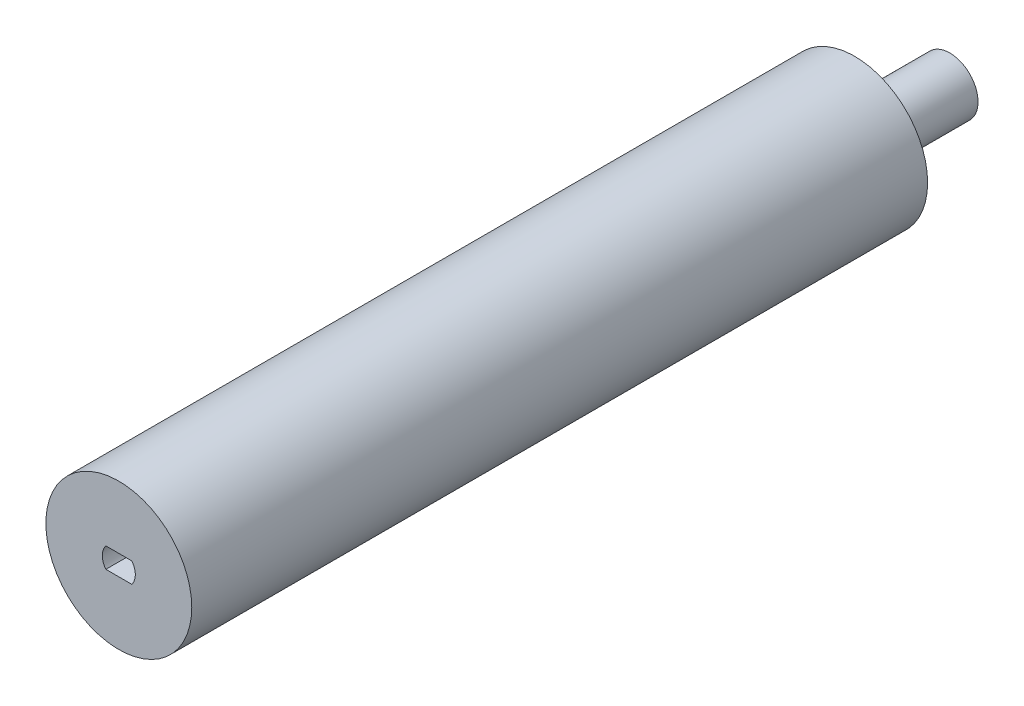
ISO-10303-21;
HEADER;
FILE_DESCRIPTION(('STEP AP214'),'2;1');
FILE_NAME('part.step','',(''),(''),'','','');
FILE_SCHEMA(('AUTOMOTIVE_DESIGN { 1 0 10303 214 1 1 1 1 }'));
ENDSEC;
DATA;
#1=APPLICATION_CONTEXT('core data for automotive mechanical design processes');
#2=APPLICATION_PROTOCOL_DEFINITION('international standard','automotive_design',2000,#1);
#3=PRODUCT_CONTEXT('',#1,'mechanical');
#4=PRODUCT('Part','Part','',(#3));
#5=PRODUCT_RELATED_PRODUCT_CATEGORY('part','',(#4));
#6=PRODUCT_DEFINITION_FORMATION('','',#4);
#7=PRODUCT_DEFINITION_CONTEXT('part definition',#1,'design');
#8=PRODUCT_DEFINITION('design','',#6,#7);
#9=PRODUCT_DEFINITION_SHAPE('','',#8);
#10=(LENGTH_UNIT() NAMED_UNIT(*) SI_UNIT(.MILLI.,.METRE.));
#11=(NAMED_UNIT(*) PLANE_ANGLE_UNIT() SI_UNIT($,.RADIAN.));
#12=(NAMED_UNIT(*) SI_UNIT($,.STERADIAN.) SOLID_ANGLE_UNIT());
#13=UNCERTAINTY_MEASURE_WITH_UNIT(LENGTH_MEASURE(1.E-05),#10,'distance_accuracy_value','');
#14=(GEOMETRIC_REPRESENTATION_CONTEXT(3) GLOBAL_UNCERTAINTY_ASSIGNED_CONTEXT((#13)) GLOBAL_UNIT_ASSIGNED_CONTEXT((#10,
#11,#12)) REPRESENTATION_CONTEXT('',''));
#15=CARTESIAN_POINT('',(0.,0.,0.));
#16=DIRECTION('',(0.,0.,1.));
#17=DIRECTION('',(1.,0.,0.));
#18=AXIS2_PLACEMENT_3D('',#15,#16,#17);
#19=CARTESIAN_POINT('',(0.,0.,-116.));
#20=DIRECTION('',(0.,0.,1.));
#21=DIRECTION('',(1.,0.,0.));
#22=AXIS2_PLACEMENT_3D('',#19,#20,#21);
#23=CYLINDRICAL_SURFACE('',#22,11.5);
#24=CARTESIAN_POINT('',(0.,0.,-116.));
#25=DIRECTION('',(0.,0.,1.));
#26=DIRECTION('',(1.,0.,0.));
#27=AXIS2_PLACEMENT_3D('',#24,#25,#26);
#28=CIRCLE('',#27,11.5);
#29=CARTESIAN_POINT('',(11.5,0.,-116.));
#30=VERTEX_POINT('',#29);
#31=EDGE_CURVE('E48',#30,#30,#28,.T.);
#32=ORIENTED_EDGE('',*,*,#31,.T.);
#33=EDGE_LOOP('',(#32));
#34=FACE_BOUND('',#33,.T.);
#35=CARTESIAN_POINT('',(0.,0.,0.));
#36=DIRECTION('',(0.,0.,1.));
#37=DIRECTION('',(1.,0.,0.));
#38=AXIS2_PLACEMENT_3D('',#35,#36,#37);
#39=CIRCLE('',#38,11.5);
#40=CARTESIAN_POINT('',(11.5,0.,0.));
#41=VERTEX_POINT('',#40);
#42=EDGE_CURVE('E42',#41,#41,#39,.T.);
#43=ORIENTED_EDGE('',*,*,#42,.F.);
#44=EDGE_LOOP('',(#43));
#45=FACE_BOUND('',#44,.T.);
#46=ADVANCED_FACE('F39',(#34,#45),#23,.T.);
#47=CARTESIAN_POINT('',(0.,0.,-116.));
#48=DIRECTION('',(0.,0.,1.));
#49=DIRECTION('',(1.,0.,0.));
#50=AXIS2_PLACEMENT_3D('',#47,#48,#49);
#51=PLANE('',#50);
#52=CARTESIAN_POINT('',(0.,0.,-116.));
#53=DIRECTION('',(0.,0.,-1.));
#54=DIRECTION('',(-1.,0.,0.));
#55=AXIS2_PLACEMENT_3D('',#52,#53,#54);
#56=CIRCLE('',#55,4.45);
#57=CARTESIAN_POINT('',(-4.45,0.,-116.));
#58=VERTEX_POINT('',#57);
#59=EDGE_CURVE('E11',#58,#58,#56,.T.);
#60=ORIENTED_EDGE('',*,*,#59,.F.);
#61=EDGE_LOOP('',(#60));
#62=FACE_BOUND('',#61,.T.);
#63=ORIENTED_EDGE('',*,*,#31,.F.);
#64=EDGE_LOOP('',(#63));
#65=FACE_BOUND('',#64,.T.);
#66=ADVANCED_FACE('F145',(#62,#65),#51,.F.);
#67=CARTESIAN_POINT('',(0.,0.,0.));
#68=DIRECTION('',(0.,0.,1.));
#69=DIRECTION('',(1.,0.,0.));
#70=AXIS2_PLACEMENT_3D('',#67,#68,#69);
#71=PLANE('',#70);
#72=CARTESIAN_POINT('',(0.00171414928473723,0.0325866269007807,0.));
#73=DIRECTION('',(0.,0.,1.));
#74=DIRECTION('',(1.,0.,0.));
#75=AXIS2_PLACEMENT_3D('',#72,#73,#74);
#76=CIRCLE('',#75,2.6);
#77=CARTESIAN_POINT('',(2.05110430247666,-1.56741337309922,0.));
#78=VERTEX_POINT('',#77);
#79=CARTESIAN_POINT('',(2.05110430247666,1.63258662690078,0.));
#80=VERTEX_POINT('',#79);
#81=EDGE_CURVE('E56',#78,#80,#76,.T.);
#82=ORIENTED_EDGE('',*,*,#81,.F.);
#83=DIRECTION('',(1.,0.,0.));
#84=VECTOR('',#83,1.);
#85=CARTESIAN_POINT('',(2.05110430247666,-1.56741337309922,0.));
#86=LINE('',#85,#84);
#87=CARTESIAN_POINT('',(-2.04767600390718,-1.56741337309922,0.));
#88=VERTEX_POINT('',#87);
#89=EDGE_CURVE('E111',#88,#78,#86,.T.);
#90=ORIENTED_EDGE('',*,*,#89,.F.);
#91=CARTESIAN_POINT('',(0.00171414928473723,0.0325866269007807,0.));
#92=DIRECTION('',(0.,0.,1.));
#93=DIRECTION('',(1.,0.,0.));
#94=AXIS2_PLACEMENT_3D('',#91,#92,#93);
#95=CIRCLE('',#94,2.6);
#96=CARTESIAN_POINT('',(-2.04767600390718,1.63258662690078,0.));
#97=VERTEX_POINT('',#96);
#98=EDGE_CURVE('E120',#97,#88,#95,.T.);
#99=ORIENTED_EDGE('',*,*,#98,.F.);
#100=DIRECTION('',(-1.,0.,0.));
#101=VECTOR('',#100,1.);
#102=CARTESIAN_POINT('',(2.05110430247666,1.63258662690078,0.));
#103=LINE('',#102,#101);
#104=EDGE_CURVE('E91',#80,#97,#103,.T.);
#105=ORIENTED_EDGE('',*,*,#104,.F.);
#106=EDGE_LOOP('',(#82,#90,#99,#105));
#107=FACE_BOUND('',#106,.T.);
#108=ORIENTED_EDGE('',*,*,#42,.T.);
#109=EDGE_LOOP('',(#108));
#110=FACE_BOUND('',#109,.T.);
#111=ADVANCED_FACE('F142',(#107,#110),#71,.T.);
#112=CARTESIAN_POINT('',(0.,0.,-131.));
#113=DIRECTION('',(0.,0.,1.));
#114=DIRECTION('',(1.,0.,0.));
#115=AXIS2_PLACEMENT_3D('',#112,#113,#114);
#116=CYLINDRICAL_SURFACE('',#115,4.45);
#117=CARTESIAN_POINT('',(0.,0.,-131.));
#118=DIRECTION('',(0.,0.,-1.));
#119=DIRECTION('',(-1.,0.,0.));
#120=AXIS2_PLACEMENT_3D('',#117,#118,#119);
#121=CIRCLE('',#120,4.45);
#122=CARTESIAN_POINT('',(-4.45,0.,-131.));
#123=VERTEX_POINT('',#122);
#124=EDGE_CURVE('E127',#123,#123,#121,.T.);
#125=ORIENTED_EDGE('',*,*,#124,.F.);
#126=EDGE_LOOP('',(#125));
#127=FACE_BOUND('',#126,.T.);
#128=ORIENTED_EDGE('',*,*,#59,.T.);
#129=EDGE_LOOP('',(#128));
#130=FACE_BOUND('',#129,.T.);
#131=ADVANCED_FACE('F154',(#127,#130),#116,.T.);
#132=CARTESIAN_POINT('',(0.,0.,-131.));
#133=DIRECTION('',(0.,0.,-1.));
#134=DIRECTION('',(-1.,0.,0.));
#135=AXIS2_PLACEMENT_3D('',#132,#133,#134);
#136=PLANE('',#135);
#137=ORIENTED_EDGE('',*,*,#124,.T.);
#138=EDGE_LOOP('',(#137));
#139=FACE_BOUND('',#138,.T.);
#140=ADVANCED_FACE('F161',(#139),#136,.T.);
#141=CARTESIAN_POINT('',(0.00171414928473723,0.0325866269007807,-10.));
#142=DIRECTION('',(0.,0.,1.));
#143=DIRECTION('',(1.,0.,0.));
#144=AXIS2_PLACEMENT_3D('',#141,#142,#143);
#145=CYLINDRICAL_SURFACE('',#144,2.6);
#146=ORIENTED_EDGE('',*,*,#81,.T.);
#147=DIRECTION('',(0.,0.,1.));
#148=VECTOR('',#147,1.);
#149=CARTESIAN_POINT('',(2.05110430247666,1.63258662690078,-10.));
#150=LINE('',#149,#148);
#151=CARTESIAN_POINT('',(2.05110430247666,1.63258662690078,-10.));
#152=VERTEX_POINT('',#151);
#153=EDGE_CURVE('E79',#152,#80,#150,.T.);
#154=ORIENTED_EDGE('',*,*,#153,.F.);
#155=CARTESIAN_POINT('',(0.00171414928473723,0.0325866269007807,-10.));
#156=DIRECTION('',(0.,0.,1.));
#157=DIRECTION('',(1.,0.,0.));
#158=AXIS2_PLACEMENT_3D('',#155,#156,#157);
#159=CIRCLE('',#158,2.6);
#160=CARTESIAN_POINT('',(2.05110430247666,-1.56741337309922,-10.));
#161=VERTEX_POINT('',#160);
#162=EDGE_CURVE('E107',#161,#152,#159,.T.);
#163=ORIENTED_EDGE('',*,*,#162,.F.);
#164=DIRECTION('',(0.,0.,1.));
#165=VECTOR('',#164,1.);
#166=CARTESIAN_POINT('',(2.05110430247666,-1.56741337309922,-10.));
#167=LINE('',#166,#165);
#168=EDGE_CURVE('E64',#161,#78,#167,.T.);
#169=ORIENTED_EDGE('',*,*,#168,.T.);
#170=EDGE_LOOP('',(#146,#154,#163,#169));
#171=FACE_BOUND('',#170,.T.);
#172=ADVANCED_FACE('F165',(#171),#145,.F.);
#173=CARTESIAN_POINT('',(2.05110430247666,-1.56741337309922,-10.));
#174=DIRECTION('',(0.,-1.,0.));
#175=DIRECTION('',(0.,0.,-1.));
#176=AXIS2_PLACEMENT_3D('',#173,#174,#175);
#177=PLANE('',#176);
#178=ORIENTED_EDGE('',*,*,#89,.T.);
#179=ORIENTED_EDGE('',*,*,#168,.F.);
#180=DIRECTION('',(1.,0.,0.));
#181=VECTOR('',#180,1.);
#182=CARTESIAN_POINT('',(2.05110430247666,-1.56741337309922,-10.));
#183=LINE('',#182,#181);
#184=CARTESIAN_POINT('',(-2.04767600390718,-1.56741337309922,-10.));
#185=VERTEX_POINT('',#184);
#186=EDGE_CURVE('E104',#185,#161,#183,.T.);
#187=ORIENTED_EDGE('',*,*,#186,.F.);
#188=DIRECTION('',(0.,0.,1.));
#189=VECTOR('',#188,1.);
#190=CARTESIAN_POINT('',(-2.04767600390718,-1.56741337309922,-10.));
#191=LINE('',#190,#189);
#192=EDGE_CURVE('E96',#185,#88,#191,.T.);
#193=ORIENTED_EDGE('',*,*,#192,.T.);
#194=EDGE_LOOP('',(#178,#179,#187,#193));
#195=FACE_BOUND('',#194,.T.);
#196=ADVANCED_FACE('F169',(#195),#177,.F.);
#197=CARTESIAN_POINT('',(0.00171414928473723,0.0325866269007807,-10.));
#198=DIRECTION('',(0.,0.,1.));
#199=DIRECTION('',(1.,0.,0.));
#200=AXIS2_PLACEMENT_3D('',#197,#198,#199);
#201=CYLINDRICAL_SURFACE('',#200,2.6);
#202=ORIENTED_EDGE('',*,*,#98,.T.);
#203=ORIENTED_EDGE('',*,*,#192,.F.);
#204=CARTESIAN_POINT('',(0.00171414928473723,0.0325866269007807,-10.));
#205=DIRECTION('',(0.,0.,1.));
#206=DIRECTION('',(1.,0.,0.));
#207=AXIS2_PLACEMENT_3D('',#204,#205,#206);
#208=CIRCLE('',#207,2.6);
#209=CARTESIAN_POINT('',(-2.04767600390718,1.63258662690078,-10.));
#210=VERTEX_POINT('',#209);
#211=EDGE_CURVE('E99',#210,#185,#208,.T.);
#212=ORIENTED_EDGE('',*,*,#211,.F.);
#213=DIRECTION('',(0.,0.,1.));
#214=VECTOR('',#213,1.);
#215=CARTESIAN_POINT('',(-2.04767600390718,1.63258662690078,-10.));
#216=LINE('',#215,#214);
#217=EDGE_CURVE('E84',#210,#97,#216,.T.);
#218=ORIENTED_EDGE('',*,*,#217,.T.);
#219=EDGE_LOOP('',(#202,#203,#212,#218));
#220=FACE_BOUND('',#219,.T.);
#221=ADVANCED_FACE('F100',(#220),#201,.F.);
#222=CARTESIAN_POINT('',(2.05110430247666,1.63258662690078,-10.));
#223=DIRECTION('',(0.,1.,0.));
#224=DIRECTION('',(0.,0.,1.));
#225=AXIS2_PLACEMENT_3D('',#222,#223,#224);
#226=PLANE('',#225);
#227=ORIENTED_EDGE('',*,*,#104,.T.);
#228=ORIENTED_EDGE('',*,*,#217,.F.);
#229=DIRECTION('',(-1.,0.,0.));
#230=VECTOR('',#229,1.);
#231=CARTESIAN_POINT('',(2.05110430247666,1.63258662690078,-10.));
#232=LINE('',#231,#230);
#233=EDGE_CURVE('E88',#152,#210,#232,.T.);
#234=ORIENTED_EDGE('',*,*,#233,.F.);
#235=ORIENTED_EDGE('',*,*,#153,.T.);
#236=EDGE_LOOP('',(#227,#228,#234,#235));
#237=FACE_BOUND('',#236,.T.);
#238=ADVANCED_FACE('F86',(#237),#226,.F.);
#239=CARTESIAN_POINT('',(0.00171414928473723,0.0325866269007807,-10.));
#240=DIRECTION('',(0.,0.,1.));
#241=DIRECTION('',(1.,0.,0.));
#242=AXIS2_PLACEMENT_3D('',#239,#240,#241);
#243=PLANE('',#242);
#244=ORIENTED_EDGE('',*,*,#162,.T.);
#245=ORIENTED_EDGE('',*,*,#233,.T.);
#246=ORIENTED_EDGE('',*,*,#211,.T.);
#247=ORIENTED_EDGE('',*,*,#186,.T.);
#248=EDGE_LOOP('',(#244,#245,#246,#247));
#249=FACE_BOUND('',#248,.T.);
#250=ADVANCED_FACE('F106',(#249),#243,.T.);
#251=CLOSED_SHELL('',(#46,#66,#111,#131,#140,#172,#196,#221,#238,#250));
#252=MANIFOLD_SOLID_BREP('B2',#251);
#253=ADVANCED_BREP_SHAPE_REPRESENTATION('',(#18,#252),#14);
#254=SHAPE_DEFINITION_REPRESENTATION(#9,#253);
ENDSEC;
END-ISO-10303-21;
